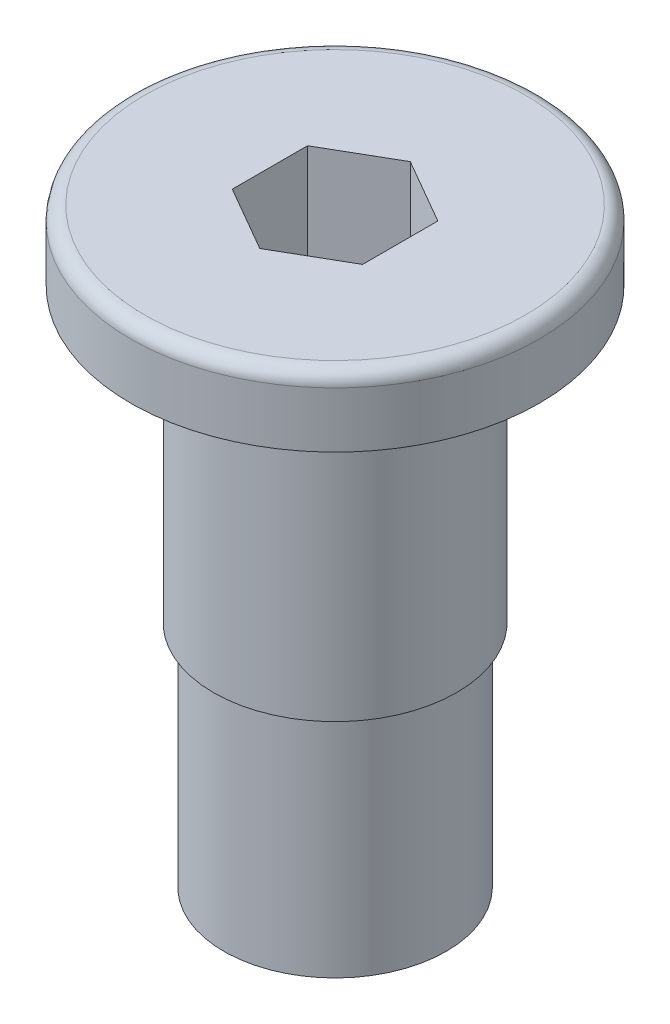
ISO-10303-21;
HEADER;
FILE_DESCRIPTION(('STEP AP214'),'2;1');
FILE_NAME('part.step','',(''),(''),'','','');
FILE_SCHEMA(('AUTOMOTIVE_DESIGN { 1 0 10303 214 1 1 1 1 }'));
ENDSEC;
DATA;
#1=APPLICATION_CONTEXT('core data for automotive mechanical design processes');
#2=APPLICATION_PROTOCOL_DEFINITION('international standard','automotive_design',2000,#1);
#3=PRODUCT_CONTEXT('',#1,'mechanical');
#4=PRODUCT('Part','Part','',(#3));
#5=PRODUCT_RELATED_PRODUCT_CATEGORY('part','',(#4));
#6=PRODUCT_DEFINITION_FORMATION('','',#4);
#7=PRODUCT_DEFINITION_CONTEXT('part definition',#1,'design');
#8=PRODUCT_DEFINITION('design','',#6,#7);
#9=PRODUCT_DEFINITION_SHAPE('','',#8);
#10=(LENGTH_UNIT() NAMED_UNIT(*) SI_UNIT(.MILLI.,.METRE.));
#11=(NAMED_UNIT(*) PLANE_ANGLE_UNIT() SI_UNIT($,.RADIAN.));
#12=(NAMED_UNIT(*) SI_UNIT($,.STERADIAN.) SOLID_ANGLE_UNIT());
#13=UNCERTAINTY_MEASURE_WITH_UNIT(LENGTH_MEASURE(1.E-05),#10,'distance_accuracy_value','');
#14=(GEOMETRIC_REPRESENTATION_CONTEXT(3) GLOBAL_UNCERTAINTY_ASSIGNED_CONTEXT((#13)) GLOBAL_UNIT_ASSIGNED_CONTEXT((#10,
#11,#12)) REPRESENTATION_CONTEXT('',''));
#15=CARTESIAN_POINT('',(0.,0.,0.));
#16=DIRECTION('',(0.,0.,1.));
#17=DIRECTION('',(1.,0.,0.));
#18=AXIS2_PLACEMENT_3D('',#15,#16,#17);
#19=CARTESIAN_POINT('',(0.,-1.27,1.3748153285078));
#20=DIRECTION('',(0.5,0.,0.866025403784439));
#21=DIRECTION('',(0.866025403784439,0.,-0.5));
#22=AXIS2_PLACEMENT_3D('',#19,#20,#21);
#23=PLANE('',#22);
#24=DIRECTION('',(0.,1.,0.));
#25=VECTOR('',#24,1.);
#26=CARTESIAN_POINT('',(1.190625,-1.27,0.687407664253899));
#27=LINE('',#26,#25);
#28=CARTESIAN_POINT('',(1.190625,1.27,0.6874076642539));
#29=VERTEX_POINT('',#28);
#30=CARTESIAN_POINT('',(1.190625,-1.27,0.687407664253899));
#31=VERTEX_POINT('',#30);
#32=EDGE_CURVE('E87',#29,#31,#27,.F.);
#33=ORIENTED_EDGE('',*,*,#32,.T.);
#34=DIRECTION('',(0.866025403784439,0.,-0.5));
#35=VECTOR('',#34,1.);
#36=CARTESIAN_POINT('',(0.,-1.27,1.3748153285078));
#37=LINE('',#36,#35);
#38=CARTESIAN_POINT('',(0.,-1.27,1.3748153285078));
#39=VERTEX_POINT('',#38);
#40=EDGE_CURVE('E76',#39,#31,#37,.T.);
#41=ORIENTED_EDGE('',*,*,#40,.F.);
#42=DIRECTION('',(0.,1.,0.));
#43=VECTOR('',#42,1.);
#44=CARTESIAN_POINT('',(0.,-1.27,1.3748153285078));
#45=LINE('',#44,#43);
#46=CARTESIAN_POINT('',(0.,1.27,1.3748153285078));
#47=VERTEX_POINT('',#46);
#48=EDGE_CURVE('E96',#39,#47,#45,.T.);
#49=ORIENTED_EDGE('',*,*,#48,.T.);
#50=DIRECTION('',(0.866025403784439,0.,-0.5));
#51=VECTOR('',#50,1.);
#52=CARTESIAN_POINT('',(0.,1.27,1.3748153285078));
#53=LINE('',#52,#51);
#54=EDGE_CURVE('E71',#29,#47,#53,.F.);
#55=ORIENTED_EDGE('',*,*,#54,.F.);
#56=EDGE_LOOP('',(#33,#41,#49,#55));
#57=FACE_BOUND('',#56,.T.);
#58=ADVANCED_FACE('F16',(#57),#23,.F.);
#59=CARTESIAN_POINT('',(1.190625,-1.27,0.687407664253899));
#60=DIRECTION('',(1.,0.,0.));
#61=DIRECTION('',(0.,1.,0.));
#62=AXIS2_PLACEMENT_3D('',#59,#60,#61);
#63=PLANE('',#62);
#64=DIRECTION('',(0.,1.,0.));
#65=VECTOR('',#64,1.);
#66=CARTESIAN_POINT('',(1.190625,-1.27,-0.687407664253897));
#67=LINE('',#66,#65);
#68=CARTESIAN_POINT('',(1.190625,1.27,-0.687407664253898));
#69=VERTEX_POINT('',#68);
#70=CARTESIAN_POINT('',(1.190625,-1.27,-0.687407664253898));
#71=VERTEX_POINT('',#70);
#72=EDGE_CURVE('E92',#69,#71,#67,.F.);
#73=ORIENTED_EDGE('',*,*,#72,.T.);
#74=DIRECTION('',(0.,0.,1.));
#75=VECTOR('',#74,1.);
#76=CARTESIAN_POINT('',(1.190625,-1.27,0.687407664253899));
#77=LINE('',#76,#75);
#78=EDGE_CURVE('E80',#31,#71,#77,.F.);
#79=ORIENTED_EDGE('',*,*,#78,.F.);
#80=ORIENTED_EDGE('',*,*,#32,.F.);
#81=DIRECTION('',(0.,0.,1.));
#82=VECTOR('',#81,1.);
#83=CARTESIAN_POINT('',(1.190625,1.27,0.687407664253899));
#84=LINE('',#83,#82);
#85=EDGE_CURVE('E94',#69,#29,#84,.T.);
#86=ORIENTED_EDGE('',*,*,#85,.F.);
#87=EDGE_LOOP('',(#73,#79,#80,#86));
#88=FACE_BOUND('',#87,.T.);
#89=ADVANCED_FACE('F90',(#88),#63,.F.);
#90=CARTESIAN_POINT('',(-1.190625,-1.27,0.687407664253898));
#91=DIRECTION('',(-0.5,0.,0.866025403784439));
#92=DIRECTION('',(0.866025403784439,0.,0.5));
#93=AXIS2_PLACEMENT_3D('',#90,#91,#92);
#94=PLANE('',#93);
#95=ORIENTED_EDGE('',*,*,#48,.F.);
#96=DIRECTION('',(0.866025403784439,0.,0.5));
#97=VECTOR('',#96,1.);
#98=CARTESIAN_POINT('',(-1.190625,-1.27,0.687407664253898));
#99=LINE('',#98,#97);
#100=CARTESIAN_POINT('',(-1.190625,-1.27,0.687407664253898));
#101=VERTEX_POINT('',#100);
#102=EDGE_CURVE('E83',#101,#39,#99,.T.);
#103=ORIENTED_EDGE('',*,*,#102,.F.);
#104=DIRECTION('',(0.,-1.,0.));
#105=VECTOR('',#104,1.);
#106=CARTESIAN_POINT('',(-1.190625,-1.27,0.687407664253898));
#107=LINE('',#106,#105);
#108=CARTESIAN_POINT('',(-1.190625,1.27,0.687407664253898));
#109=VERTEX_POINT('',#108);
#110=EDGE_CURVE('E157',#101,#109,#107,.F.);
#111=ORIENTED_EDGE('',*,*,#110,.T.);
#112=DIRECTION('',(0.866025403784439,0.,0.5));
#113=VECTOR('',#112,1.);
#114=CARTESIAN_POINT('',(-1.190625,1.27,0.687407664253897));
#115=LINE('',#114,#113);
#116=EDGE_CURVE('E169',#47,#109,#115,.F.);
#117=ORIENTED_EDGE('',*,*,#116,.F.);
#118=EDGE_LOOP('',(#95,#103,#111,#117));
#119=FACE_BOUND('',#118,.T.);
#120=ADVANCED_FACE('F172',(#119),#94,.F.);
#121=CARTESIAN_POINT('',(1.190625,-1.27,-0.687407664253898));
#122=DIRECTION('',(0.5,0.,-0.866025403784439));
#123=DIRECTION('',(-0.866025403784439,0.,-0.5));
#124=AXIS2_PLACEMENT_3D('',#121,#122,#123);
#125=PLANE('',#124);
#126=DIRECTION('',(0.,1.,0.));
#127=VECTOR('',#126,1.);
#128=CARTESIAN_POINT('',(0.,-1.27,-1.3748153285078));
#129=LINE('',#128,#127);
#130=CARTESIAN_POINT('',(0.,1.27,-1.3748153285078));
#131=VERTEX_POINT('',#130);
#132=CARTESIAN_POINT('',(0.,-1.27,-1.3748153285078));
#133=VERTEX_POINT('',#132);
#134=EDGE_CURVE('E152',#131,#133,#129,.F.);
#135=ORIENTED_EDGE('',*,*,#134,.T.);
#136=DIRECTION('',(-0.866025403784439,0.,-0.5));
#137=VECTOR('',#136,1.);
#138=CARTESIAN_POINT('',(1.190625,-1.27,-0.687407664253898));
#139=LINE('',#138,#137);
#140=EDGE_CURVE('E163',#71,#133,#139,.T.);
#141=ORIENTED_EDGE('',*,*,#140,.F.);
#142=ORIENTED_EDGE('',*,*,#72,.F.);
#143=DIRECTION('',(-0.866025403784439,0.,-0.5));
#144=VECTOR('',#143,1.);
#145=CARTESIAN_POINT('',(1.190625,1.27,-0.6874076642539));
#146=LINE('',#145,#144);
#147=EDGE_CURVE('E165',#131,#69,#146,.F.);
#148=ORIENTED_EDGE('',*,*,#147,.F.);
#149=EDGE_LOOP('',(#135,#141,#142,#148));
#150=FACE_BOUND('',#149,.T.);
#151=ADVANCED_FACE('F182',(#150),#125,.F.);
#152=CARTESIAN_POINT('',(0.,-1.27,-1.3748153285078));
#153=DIRECTION('',(0.,1.,0.));
#154=DIRECTION('',(-1.,0.,0.));
#155=AXIS2_PLACEMENT_3D('',#152,#153,#154);
#156=PLANE('',#155);
#157=ORIENTED_EDGE('',*,*,#40,.T.);
#158=ORIENTED_EDGE('',*,*,#78,.T.);
#159=ORIENTED_EDGE('',*,*,#140,.T.);
#160=DIRECTION('',(-0.866025403784439,0.,0.5));
#161=VECTOR('',#160,1.);
#162=CARTESIAN_POINT('',(0.,-1.27,-1.3748153285078));
#163=LINE('',#162,#161);
#164=CARTESIAN_POINT('',(-1.190625,-1.27,-0.687407664253899));
#165=VERTEX_POINT('',#164);
#166=EDGE_CURVE('E150',#133,#165,#163,.T.);
#167=ORIENTED_EDGE('',*,*,#166,.T.);
#168=DIRECTION('',(0.,0.,1.));
#169=VECTOR('',#168,1.);
#170=CARTESIAN_POINT('',(-1.190625,-1.27,-0.687407664253899));
#171=LINE('',#170,#169);
#172=EDGE_CURVE('E160',#165,#101,#171,.T.);
#173=ORIENTED_EDGE('',*,*,#172,.T.);
#174=ORIENTED_EDGE('',*,*,#102,.T.);
#175=EDGE_LOOP('',(#157,#158,#159,#167,#173,#174));
#176=FACE_BOUND('',#175,.T.);
#177=ADVANCED_FACE('F77',(#176),#156,.T.);
#178=CARTESIAN_POINT('',(-1.190625,-1.27,-0.687407664253899));
#179=DIRECTION('',(-1.,0.,0.));
#180=DIRECTION('',(0.,-1.,0.));
#181=AXIS2_PLACEMENT_3D('',#178,#179,#180);
#182=PLANE('',#181);
#183=ORIENTED_EDGE('',*,*,#110,.F.);
#184=ORIENTED_EDGE('',*,*,#172,.F.);
#185=DIRECTION('',(0.,1.,0.));
#186=VECTOR('',#185,1.);
#187=CARTESIAN_POINT('',(-1.190625,-1.27,-0.687407664253899));
#188=LINE('',#187,#186);
#189=CARTESIAN_POINT('',(-1.190625,1.27,-0.687407664253898));
#190=VERTEX_POINT('',#189);
#191=EDGE_CURVE('E141',#165,#190,#188,.T.);
#192=ORIENTED_EDGE('',*,*,#191,.T.);
#193=DIRECTION('',(0.,0.,1.));
#194=VECTOR('',#193,1.);
#195=CARTESIAN_POINT('',(-1.190625,1.27,-0.687407664253899));
#196=LINE('',#195,#194);
#197=EDGE_CURVE('E154',#109,#190,#196,.F.);
#198=ORIENTED_EDGE('',*,*,#197,.F.);
#199=EDGE_LOOP('',(#183,#184,#192,#198));
#200=FACE_BOUND('',#199,.T.);
#201=ADVANCED_FACE('F189',(#200),#182,.F.);
#202=CARTESIAN_POINT('',(0.,-1.27,-1.3748153285078));
#203=DIRECTION('',(-0.5,0.,-0.866025403784439));
#204=DIRECTION('',(-0.866025403784439,0.,0.5));
#205=AXIS2_PLACEMENT_3D('',#202,#203,#204);
#206=PLANE('',#205);
#207=ORIENTED_EDGE('',*,*,#191,.F.);
#208=ORIENTED_EDGE('',*,*,#166,.F.);
#209=ORIENTED_EDGE('',*,*,#134,.F.);
#210=DIRECTION('',(0.866025403784439,0.,-0.5));
#211=VECTOR('',#210,1.);
#212=CARTESIAN_POINT('',(-1.190625,1.27,-0.687407664253899));
#213=LINE('',#212,#211);
#214=EDGE_CURVE('E149',#190,#131,#213,.T.);
#215=ORIENTED_EDGE('',*,*,#214,.F.);
#216=EDGE_LOOP('',(#207,#208,#209,#215));
#217=FACE_BOUND('',#216,.T.);
#218=ADVANCED_FACE('F187',(#217),#206,.F.);
#219=CARTESIAN_POINT('',(0.,1.27,0.));
#220=DIRECTION('',(0.,1.,0.));
#221=DIRECTION('',(-1.,0.,0.));
#222=AXIS2_PLACEMENT_3D('',#219,#220,#221);
#223=PLANE('',#222);
#224=ORIENTED_EDGE('',*,*,#197,.T.);
#225=ORIENTED_EDGE('',*,*,#214,.T.);
#226=ORIENTED_EDGE('',*,*,#147,.T.);
#227=ORIENTED_EDGE('',*,*,#85,.T.);
#228=ORIENTED_EDGE('',*,*,#54,.T.);
#229=ORIENTED_EDGE('',*,*,#116,.T.);
#230=EDGE_LOOP('',(#224,#225,#226,#227,#228,#229));
#231=FACE_BOUND('',#230,.T.);
#232=CARTESIAN_POINT('',(0.,1.27,0.));
#233=DIRECTION('',(0.,-1.,0.));
#234=DIRECTION('',(1.,0.,0.));
#235=AXIS2_PLACEMENT_3D('',#232,#233,#234);
#236=CIRCLE('',#235,3.4798);
#237=CARTESIAN_POINT('',(3.47980000000001,1.27,0.));
#238=VERTEX_POINT('',#237);
#239=CARTESIAN_POINT('',(-3.47979999999999,1.27000000000001,0.));
#240=VERTEX_POINT('',#239);
#241=EDGE_CURVE('E35',#238,#240,#236,.T.);
#242=ORIENTED_EDGE('',*,*,#241,.F.);
#243=CARTESIAN_POINT('',(0.,1.27,0.));
#244=DIRECTION('',(0.,-1.,0.));
#245=DIRECTION('',(-1.,0.,0.));
#246=AXIS2_PLACEMENT_3D('',#243,#244,#245);
#247=CIRCLE('',#246,3.4798);
#248=EDGE_CURVE('E115',#240,#238,#247,.T.);
#249=ORIENTED_EDGE('',*,*,#248,.F.);
#250=EDGE_LOOP('',(#242,#249));
#251=FACE_BOUND('',#250,.T.);
#252=ADVANCED_FACE('F129',(#231,#251),#223,.T.);
#253=CARTESIAN_POINT('',(0.,1.016,0.));
#254=DIRECTION('',(0.,1.,0.));
#255=DIRECTION('',(-1.,0.,0.));
#256=AXIS2_PLACEMENT_3D('',#253,#254,#255);
#257=TOROIDAL_SURFACE('',#256,3.4798,0.254);
#258=CARTESIAN_POINT('',(0.,1.016,0.));
#259=DIRECTION('',(0.,-1.,0.));
#260=DIRECTION('',(1.,0.,0.));
#261=AXIS2_PLACEMENT_3D('',#258,#259,#260);
#262=CIRCLE('',#261,3.7338);
#263=CARTESIAN_POINT('',(3.73380000000001,1.016,0.));
#264=VERTEX_POINT('',#263);
#265=EDGE_CURVE('E111',#264,#264,#262,.T.);
#266=ORIENTED_EDGE('',*,*,#265,.F.);
#267=EDGE_LOOP('',(#266));
#268=FACE_BOUND('',#267,.T.);
#269=ORIENTED_EDGE('',*,*,#248,.T.);
#270=ORIENTED_EDGE('',*,*,#241,.T.);
#271=EDGE_LOOP('',(#269,#270));
#272=FACE_BOUND('',#271,.T.);
#273=ADVANCED_FACE('F123',(#268,#272),#257,.T.);
#274=CARTESIAN_POINT('',(2.032,-9.525,0.));
#275=DIRECTION('',(0.,-1.,0.));
#276=DIRECTION('',(1.,0.,0.));
#277=AXIS2_PLACEMENT_3D('',#274,#275,#276);
#278=PLANE('',#277);
#279=CARTESIAN_POINT('',(0.,-9.525,0.));
#280=DIRECTION('',(0.,-1.,0.));
#281=DIRECTION('',(1.,0.,0.));
#282=AXIS2_PLACEMENT_3D('',#279,#280,#281);
#283=CIRCLE('',#282,2.032);
#284=CARTESIAN_POINT('',(2.032,-9.525,0.));
#285=VERTEX_POINT('',#284);
#286=EDGE_CURVE('E109',#285,#285,#283,.F.);
#287=ORIENTED_EDGE('',*,*,#286,.F.);
#288=EDGE_LOOP('',(#287));
#289=FACE_BOUND('',#288,.T.);
#290=ADVANCED_FACE('F128',(#289),#278,.T.);
#291=CARTESIAN_POINT('',(0.,-9.525,0.));
#292=DIRECTION('',(0.,-1.,0.));
#293=DIRECTION('',(1.,0.,0.));
#294=AXIS2_PLACEMENT_3D('',#291,#292,#293);
#295=CYLINDRICAL_SURFACE('',#294,3.7338);
#296=ORIENTED_EDGE('',*,*,#265,.T.);
#297=EDGE_LOOP('',(#296));
#298=FACE_BOUND('',#297,.T.);
#299=CARTESIAN_POINT('',(0.,0.,0.));
#300=DIRECTION('',(0.,-1.,0.));
#301=DIRECTION('',(1.,0.,0.));
#302=AXIS2_PLACEMENT_3D('',#299,#300,#301);
#303=CIRCLE('',#302,3.7338);
#304=CARTESIAN_POINT('',(3.73380000000001,0.,0.));
#305=VERTEX_POINT('',#304);
#306=EDGE_CURVE('E106',#305,#305,#303,.T.);
#307=ORIENTED_EDGE('',*,*,#306,.F.);
#308=EDGE_LOOP('',(#307));
#309=FACE_BOUND('',#308,.T.);
#310=ADVANCED_FACE('F216',(#298,#309),#295,.T.);
#311=CARTESIAN_POINT('',(0.,-9.525,0.));
#312=DIRECTION('',(0.,-1.,0.));
#313=DIRECTION('',(1.,0.,0.));
#314=AXIS2_PLACEMENT_3D('',#311,#312,#313);
#315=CYLINDRICAL_SURFACE('',#314,2.032);
#316=CARTESIAN_POINT('',(0.,-5.334,0.));
#317=DIRECTION('',(0.,-1.,0.));
#318=DIRECTION('',(1.,0.,0.));
#319=AXIS2_PLACEMENT_3D('',#316,#317,#318);
#320=CIRCLE('',#319,2.032);
#321=CARTESIAN_POINT('',(2.032,-5.334,0.));
#322=VERTEX_POINT('',#321);
#323=EDGE_CURVE('E103',#322,#322,#320,.F.);
#324=ORIENTED_EDGE('',*,*,#323,.F.);
#325=EDGE_LOOP('',(#324));
#326=FACE_BOUND('',#325,.T.);
#327=ORIENTED_EDGE('',*,*,#286,.T.);
#328=EDGE_LOOP('',(#327));
#329=FACE_BOUND('',#328,.T.);
#330=ADVANCED_FACE('F213',(#326,#329),#315,.T.);
#331=CARTESIAN_POINT('',(3.73380000000001,0.,0.));
#332=DIRECTION('',(0.,-1.,0.));
#333=DIRECTION('',(1.,0.,0.));
#334=AXIS2_PLACEMENT_3D('',#331,#332,#333);
#335=PLANE('',#334);
#336=CARTESIAN_POINT('',(0.,0.,0.));
#337=DIRECTION('',(0.,-1.,0.));
#338=DIRECTION('',(1.,0.,0.));
#339=AXIS2_PLACEMENT_3D('',#336,#337,#338);
#340=CIRCLE('',#339,2.22249999999999);
#341=CARTESIAN_POINT('',(2.2225,0.,0.));
#342=VERTEX_POINT('',#341);
#343=EDGE_CURVE('E27',#342,#342,#340,.T.);
#344=ORIENTED_EDGE('',*,*,#343,.F.);
#345=EDGE_LOOP('',(#344));
#346=FACE_BOUND('',#345,.T.);
#347=ORIENTED_EDGE('',*,*,#306,.T.);
#348=EDGE_LOOP('',(#347));
#349=FACE_BOUND('',#348,.T.);
#350=ADVANCED_FACE('F206',(#346,#349),#335,.T.);
#351=CARTESIAN_POINT('',(2.2225,-5.334,0.));
#352=DIRECTION('',(0.,-1.,0.));
#353=DIRECTION('',(1.,0.,0.));
#354=AXIS2_PLACEMENT_3D('',#351,#352,#353);
#355=PLANE('',#354);
#356=ORIENTED_EDGE('',*,*,#323,.T.);
#357=EDGE_LOOP('',(#356));
#358=FACE_BOUND('',#357,.T.);
#359=CARTESIAN_POINT('',(0.,-5.334,0.));
#360=DIRECTION('',(0.,-1.,0.));
#361=DIRECTION('',(1.,0.,0.));
#362=AXIS2_PLACEMENT_3D('',#359,#360,#361);
#363=CIRCLE('',#362,2.22249999999999);
#364=CARTESIAN_POINT('',(2.2225,-5.334,0.));
#365=VERTEX_POINT('',#364);
#366=EDGE_CURVE('E11',#365,#365,#363,.F.);
#367=ORIENTED_EDGE('',*,*,#366,.F.);
#368=EDGE_LOOP('',(#367));
#369=FACE_BOUND('',#368,.T.);
#370=ADVANCED_FACE('F200',(#358,#369),#355,.T.);
#371=CARTESIAN_POINT('',(0.,-9.525,0.));
#372=DIRECTION('',(0.,-1.,0.));
#373=DIRECTION('',(1.,0.,0.));
#374=AXIS2_PLACEMENT_3D('',#371,#372,#373);
#375=CYLINDRICAL_SURFACE('',#374,2.22249999999999);
#376=ORIENTED_EDGE('',*,*,#366,.T.);
#377=EDGE_LOOP('',(#376));
#378=FACE_BOUND('',#377,.T.);
#379=ORIENTED_EDGE('',*,*,#343,.T.);
#380=EDGE_LOOP('',(#379));
#381=FACE_BOUND('',#380,.T.);
#382=ADVANCED_FACE('F198',(#378,#381),#375,.T.);
#383=CLOSED_SHELL('',(#58,#89,#120,#151,#177,#201,#218,#252,#273,#290,#310,#330,#350,#370,#382));
#384=MANIFOLD_SOLID_BREP('B1',#383);
#385=ADVANCED_BREP_SHAPE_REPRESENTATION('',(#18,#384),#14);
#386=SHAPE_DEFINITION_REPRESENTATION(#9,#385);
ENDSEC;
END-ISO-10303-21;
